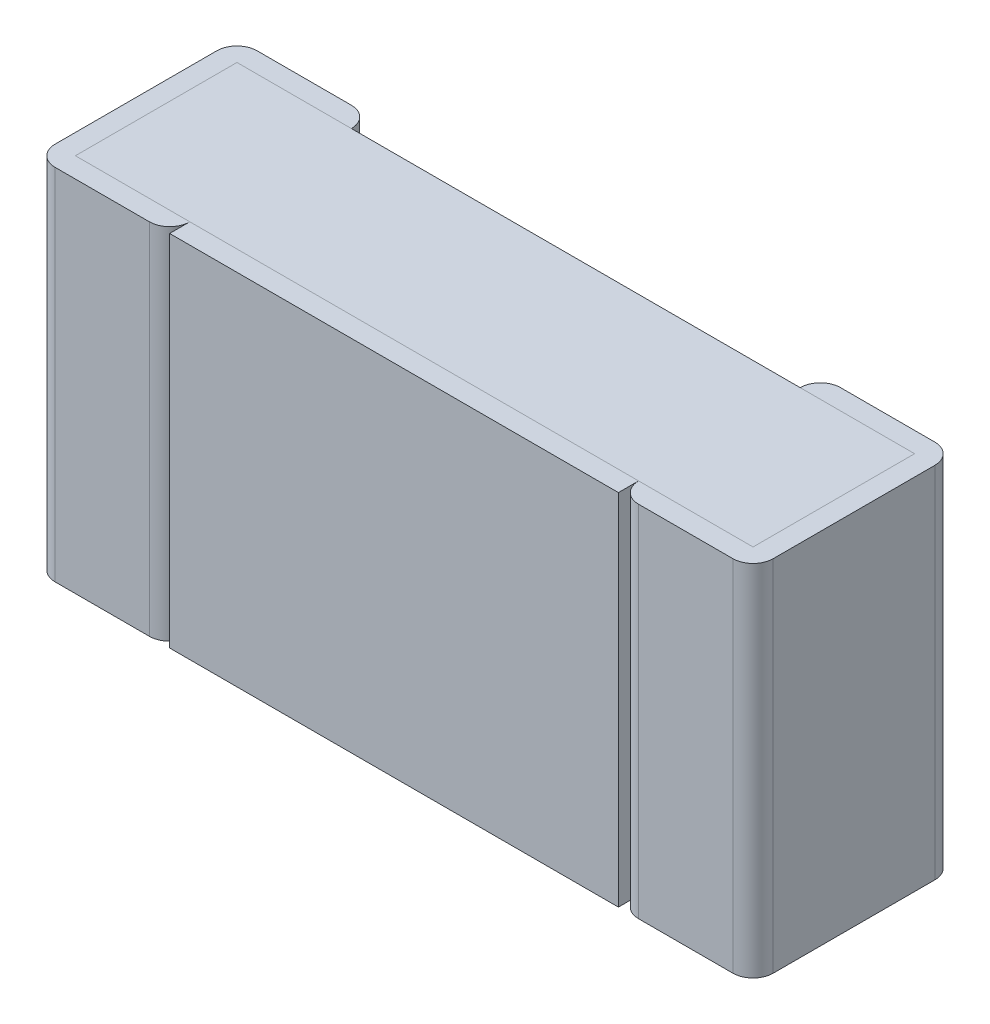
ISO-10303-21;
HEADER;
FILE_DESCRIPTION(('STEP AP214'),'2;1');
FILE_NAME('part.step','',(''),(''),'','','');
FILE_SCHEMA(('AUTOMOTIVE_DESIGN { 1 0 10303 214 1 1 1 1 }'));
ENDSEC;
DATA;
#1=APPLICATION_CONTEXT('core data for automotive mechanical design processes');
#2=APPLICATION_PROTOCOL_DEFINITION('international standard','automotive_design',2000,#1);
#3=PRODUCT_CONTEXT('',#1,'mechanical');
#4=PRODUCT('Part','Part','',(#3));
#5=PRODUCT_RELATED_PRODUCT_CATEGORY('part','',(#4));
#6=PRODUCT_DEFINITION_FORMATION('','',#4);
#7=PRODUCT_DEFINITION_CONTEXT('part definition',#1,'design');
#8=PRODUCT_DEFINITION('design','',#6,#7);
#9=PRODUCT_DEFINITION_SHAPE('','',#8);
#10=(LENGTH_UNIT() NAMED_UNIT(*) SI_UNIT(.MILLI.,.METRE.));
#11=(NAMED_UNIT(*) PLANE_ANGLE_UNIT() SI_UNIT($,.RADIAN.));
#12=(NAMED_UNIT(*) SI_UNIT($,.STERADIAN.) SOLID_ANGLE_UNIT());
#13=UNCERTAINTY_MEASURE_WITH_UNIT(LENGTH_MEASURE(1.E-05),#10,'distance_accuracy_value','');
#14=(GEOMETRIC_REPRESENTATION_CONTEXT(3) GLOBAL_UNCERTAINTY_ASSIGNED_CONTEXT((#13)) GLOBAL_UNIT_ASSIGNED_CONTEXT((#10,
#11,#12)) REPRESENTATION_CONTEXT('',''));
#15=CARTESIAN_POINT('',(0.,0.,0.));
#16=DIRECTION('',(0.,0.,1.));
#17=DIRECTION('',(1.,0.,0.));
#18=AXIS2_PLACEMENT_3D('',#15,#16,#17);
#19=CARTESIAN_POINT('',(162.543744279938,115.36204329235,112.661582908599));
#20=DIRECTION('',(0.,0.,1.));
#21=DIRECTION('',(1.,0.,0.));
#22=AXIS2_PLACEMENT_3D('',#19,#20,#21);
#23=PLANE('',#22);
#24=DIRECTION('',(0.,1.,0.));
#25=VECTOR('',#24,1.);
#26=CARTESIAN_POINT('',(162.543744279938,115.36204329235,112.661582908599));
#27=LINE('',#26,#25);
#28=CARTESIAN_POINT('',(162.543744279938,115.36204329235,112.661582908599));
#29=VERTEX_POINT('',#28);
#30=CARTESIAN_POINT('',(162.543744279938,116.16204329235,112.661582908599));
#31=VERTEX_POINT('',#30);
#32=EDGE_CURVE('E67',#29,#31,#27,.T.);
#33=ORIENTED_EDGE('',*,*,#32,.F.);
#34=DIRECTION('',(1.,0.,0.));
#35=VECTOR('',#34,1.);
#36=CARTESIAN_POINT('',(162.543744279938,115.36204329235,112.661582908599));
#37=LINE('',#36,#35);
#38=CARTESIAN_POINT('',(163.543744279938,115.36204329235,112.661582908599));
#39=VERTEX_POINT('',#38);
#40=EDGE_CURVE('E11',#29,#39,#37,.T.);
#41=ORIENTED_EDGE('',*,*,#40,.T.);
#42=DIRECTION('',(0.,1.,0.));
#43=VECTOR('',#42,1.);
#44=CARTESIAN_POINT('',(163.543744279938,115.36204329235,112.661582908599));
#45=LINE('',#44,#43);
#46=CARTESIAN_POINT('',(163.543744279938,116.16204329235,112.661582908599));
#47=VERTEX_POINT('',#46);
#48=EDGE_CURVE('E55',#39,#47,#45,.T.);
#49=ORIENTED_EDGE('',*,*,#48,.T.);
#50=DIRECTION('',(1.,0.,0.));
#51=VECTOR('',#50,1.);
#52=CARTESIAN_POINT('',(162.543744279938,116.16204329235,112.661582908599));
#53=LINE('',#52,#51);
#54=EDGE_CURVE('E319',#31,#47,#53,.T.);
#55=ORIENTED_EDGE('',*,*,#54,.F.);
#56=EDGE_LOOP('',(#33,#41,#49,#55));
#57=FACE_BOUND('',#56,.T.);
#58=ADVANCED_FACE('F44',(#57),#23,.T.);
#59=CARTESIAN_POINT('',(163.543744279938,115.36204329235,112.616582908599));
#60=DIRECTION('',(1.,0.,0.));
#61=DIRECTION('',(0.,1.,0.));
#62=AXIS2_PLACEMENT_3D('',#59,#60,#61);
#63=PLANE('',#62);
#64=DIRECTION('',(0.,0.,1.));
#65=VECTOR('',#64,1.);
#66=CARTESIAN_POINT('',(163.543744279938,115.36204329235,112.616582908599));
#67=LINE('',#66,#65);
#68=CARTESIAN_POINT('',(163.543744279938,115.36204329235,112.616582908599));
#69=VERTEX_POINT('',#68);
#70=EDGE_CURVE('E261',#69,#39,#67,.T.);
#71=ORIENTED_EDGE('',*,*,#70,.F.);
#72=DIRECTION('',(0.,1.,0.));
#73=VECTOR('',#72,1.);
#74=CARTESIAN_POINT('',(163.543744279938,115.36204329235,112.616582908599));
#75=LINE('',#74,#73);
#76=CARTESIAN_POINT('',(163.543744279938,116.16204329235,112.616582908599));
#77=VERTEX_POINT('',#76);
#78=EDGE_CURVE('E333',#69,#77,#75,.T.);
#79=ORIENTED_EDGE('',*,*,#78,.T.);
#80=DIRECTION('',(0.,0.,1.));
#81=VECTOR('',#80,1.);
#82=CARTESIAN_POINT('',(163.543744279938,116.16204329235,112.616582908599));
#83=LINE('',#82,#81);
#84=EDGE_CURVE('E329',#77,#47,#83,.T.);
#85=ORIENTED_EDGE('',*,*,#84,.T.);
#86=ORIENTED_EDGE('',*,*,#48,.F.);
#87=EDGE_LOOP('',(#71,#79,#85,#86));
#88=FACE_BOUND('',#87,.T.);
#89=ADVANCED_FACE('F581',(#88),#63,.T.);
#90=CARTESIAN_POINT('',(163.588744279938,115.36204329235,112.616582908599));
#91=DIRECTION('',(0.,1.,0.));
#92=DIRECTION('',(-1.,0.,0.));
#93=AXIS2_PLACEMENT_3D('',#90,#91,#92);
#94=CYLINDRICAL_SURFACE('',#93,0.0449999999999895);
#95=CARTESIAN_POINT('',(163.588744279938,115.36204329235,112.616582908599));
#96=DIRECTION('',(0.,1.,0.));
#97=DIRECTION('',(0.,0.,1.));
#98=AXIS2_PLACEMENT_3D('',#95,#96,#97);
#99=CIRCLE('',#98,0.0450000000000034);
#100=CARTESIAN_POINT('',(163.588744279938,115.36204329235,112.661582908599));
#101=VERTEX_POINT('',#100);
#102=EDGE_CURVE('E334',#69,#101,#99,.T.);
#103=ORIENTED_EDGE('',*,*,#102,.T.);
#104=DIRECTION('',(0.,1.,0.));
#105=VECTOR('',#104,1.);
#106=CARTESIAN_POINT('',(163.588744279938,115.36204329235,112.661582908599));
#107=LINE('',#106,#105);
#108=CARTESIAN_POINT('',(163.588744279938,116.16204329235,112.661582908599));
#109=VERTEX_POINT('',#108);
#110=EDGE_CURVE('E342',#101,#109,#107,.T.);
#111=ORIENTED_EDGE('',*,*,#110,.T.);
#112=CARTESIAN_POINT('',(163.588744279938,116.16204329235,112.616582908599));
#113=DIRECTION('',(0.,1.,0.));
#114=DIRECTION('',(0.,0.,1.));
#115=AXIS2_PLACEMENT_3D('',#112,#113,#114);
#116=CIRCLE('',#115,0.0450000000000034);
#117=EDGE_CURVE('E300',#77,#109,#116,.T.);
#118=ORIENTED_EDGE('',*,*,#117,.F.);
#119=ORIENTED_EDGE('',*,*,#78,.F.);
#120=EDGE_LOOP('',(#103,#111,#118,#119));
#121=FACE_BOUND('',#120,.T.);
#122=ADVANCED_FACE('F583',(#121),#94,.T.);
#123=CARTESIAN_POINT('',(163.543744279938,115.36204329235,112.661582908599));
#124=DIRECTION('',(0.,0.,1.));
#125=DIRECTION('',(1.,0.,0.));
#126=AXIS2_PLACEMENT_3D('',#123,#124,#125);
#127=PLANE('',#126);
#128=DIRECTION('',(1.,0.,0.));
#129=VECTOR('',#128,1.);
#130=CARTESIAN_POINT('',(163.543744279938,116.16204329235,112.661582908599));
#131=LINE('',#130,#129);
#132=CARTESIAN_POINT('',(163.798744279938,116.16204329235,112.661582908599));
#133=VERTEX_POINT('',#132);
#134=EDGE_CURVE('E298',#109,#133,#131,.T.);
#135=ORIENTED_EDGE('',*,*,#134,.F.);
#136=ORIENTED_EDGE('',*,*,#110,.F.);
#137=DIRECTION('',(1.,0.,0.));
#138=VECTOR('',#137,1.);
#139=CARTESIAN_POINT('',(163.543744279938,115.36204329235,112.661582908599));
#140=LINE('',#139,#138);
#141=CARTESIAN_POINT('',(163.798744279938,115.36204329235,112.661582908599));
#142=VERTEX_POINT('',#141);
#143=EDGE_CURVE('E346',#101,#142,#140,.T.);
#144=ORIENTED_EDGE('',*,*,#143,.T.);
#145=DIRECTION('',(0.,1.,0.));
#146=VECTOR('',#145,1.);
#147=CARTESIAN_POINT('',(163.798744279938,115.36204329235,112.661582908599));
#148=LINE('',#147,#146);
#149=EDGE_CURVE('E399',#142,#133,#148,.T.);
#150=ORIENTED_EDGE('',*,*,#149,.T.);
#151=EDGE_LOOP('',(#135,#136,#144,#150));
#152=FACE_BOUND('',#151,.T.);
#153=ADVANCED_FACE('F474',(#152),#127,.T.);
#154=CARTESIAN_POINT('',(163.798744279938,115.36204329235,112.616582908599));
#155=DIRECTION('',(0.,1.,0.));
#156=DIRECTION('',(1.,0.,0.));
#157=AXIS2_PLACEMENT_3D('',#154,#155,#156);
#158=CYLINDRICAL_SURFACE('',#157,0.0449999999999895);
#159=DIRECTION('',(0.,1.,0.));
#160=VECTOR('',#159,1.);
#161=CARTESIAN_POINT('',(163.843744279938,115.36204329235,112.616582908599));
#162=LINE('',#161,#160);
#163=CARTESIAN_POINT('',(163.843744279938,115.36204329235,112.616582908599));
#164=VERTEX_POINT('',#163);
#165=CARTESIAN_POINT('',(163.843744279938,116.16204329235,112.616582908599));
#166=VERTEX_POINT('',#165);
#167=EDGE_CURVE('E259',#164,#166,#162,.T.);
#168=ORIENTED_EDGE('',*,*,#167,.T.);
#169=CARTESIAN_POINT('',(163.798744279938,116.16204329235,112.616582908599));
#170=DIRECTION('',(0.,-1.,0.));
#171=DIRECTION('',(0.,0.,1.));
#172=AXIS2_PLACEMENT_3D('',#169,#170,#171);
#173=CIRCLE('',#172,0.0450000000000034);
#174=EDGE_CURVE('E255',#166,#133,#173,.T.);
#175=ORIENTED_EDGE('',*,*,#174,.T.);
#176=ORIENTED_EDGE('',*,*,#149,.F.);
#177=CARTESIAN_POINT('',(163.798744279938,115.36204329235,112.616582908599));
#178=DIRECTION('',(0.,-1.,0.));
#179=DIRECTION('',(0.,0.,1.));
#180=AXIS2_PLACEMENT_3D('',#177,#178,#179);
#181=CIRCLE('',#180,0.0450000000000034);
#182=EDGE_CURVE('E287',#164,#142,#181,.T.);
#183=ORIENTED_EDGE('',*,*,#182,.F.);
#184=EDGE_LOOP('',(#168,#175,#176,#183));
#185=FACE_BOUND('',#184,.T.);
#186=ADVANCED_FACE('F472',(#185),#158,.T.);
#187=CARTESIAN_POINT('',(163.843744279938,115.36204329235,112.211582908599));
#188=DIRECTION('',(1.,0.,0.));
#189=DIRECTION('',(0.,1.,0.));
#190=AXIS2_PLACEMENT_3D('',#187,#188,#189);
#191=PLANE('',#190);
#192=DIRECTION('',(0.,0.,1.));
#193=VECTOR('',#192,1.);
#194=CARTESIAN_POINT('',(163.843744279938,115.36204329235,112.211582908599));
#195=LINE('',#194,#193);
#196=CARTESIAN_POINT('',(163.843744279938,115.36204329235,112.256582908599));
#197=VERTEX_POINT('',#196);
#198=EDGE_CURVE('E283',#197,#164,#195,.T.);
#199=ORIENTED_EDGE('',*,*,#198,.F.);
#200=DIRECTION('',(0.,1.,0.));
#201=VECTOR('',#200,1.);
#202=CARTESIAN_POINT('',(163.843744279938,115.36204329235,112.256582908599));
#203=LINE('',#202,#201);
#204=CARTESIAN_POINT('',(163.843744279938,116.16204329235,112.256582908599));
#205=VERTEX_POINT('',#204);
#206=EDGE_CURVE('E260',#197,#205,#203,.T.);
#207=ORIENTED_EDGE('',*,*,#206,.T.);
#208=DIRECTION('',(0.,0.,1.));
#209=VECTOR('',#208,1.);
#210=CARTESIAN_POINT('',(163.843744279938,116.16204329235,112.211582908599));
#211=LINE('',#210,#209);
#212=EDGE_CURVE('E328',#205,#166,#211,.T.);
#213=ORIENTED_EDGE('',*,*,#212,.T.);
#214=ORIENTED_EDGE('',*,*,#167,.F.);
#215=EDGE_LOOP('',(#199,#207,#213,#214));
#216=FACE_BOUND('',#215,.T.);
#217=ADVANCED_FACE('F465',(#216),#191,.T.);
#218=CARTESIAN_POINT('',(163.798744279938,115.36204329235,112.256582908599));
#219=DIRECTION('',(0.,1.,0.));
#220=DIRECTION('',(1.,0.,0.));
#221=AXIS2_PLACEMENT_3D('',#218,#219,#220);
#222=CYLINDRICAL_SURFACE('',#221,0.0449999999999895);
#223=CARTESIAN_POINT('',(163.798744279938,115.36204329235,112.256582908599));
#224=DIRECTION('',(0.,1.,0.));
#225=DIRECTION('',(0.,0.,1.));
#226=AXIS2_PLACEMENT_3D('',#223,#224,#225);
#227=CIRCLE('',#226,0.0450000000000034);
#228=CARTESIAN_POINT('',(163.798744279938,115.36204329235,112.211582908599));
#229=VERTEX_POINT('',#228);
#230=EDGE_CURVE('E325',#197,#229,#227,.T.);
#231=ORIENTED_EDGE('',*,*,#230,.T.);
#232=DIRECTION('',(0.,1.,0.));
#233=VECTOR('',#232,1.);
#234=CARTESIAN_POINT('',(163.798744279938,115.36204329235,112.211582908599));
#235=LINE('',#234,#233);
#236=CARTESIAN_POINT('',(163.798744279938,116.16204329235,112.211582908599));
#237=VERTEX_POINT('',#236);
#238=EDGE_CURVE('E323',#229,#237,#235,.T.);
#239=ORIENTED_EDGE('',*,*,#238,.T.);
#240=CARTESIAN_POINT('',(163.798744279938,116.16204329235,112.256582908599));
#241=DIRECTION('',(0.,1.,0.));
#242=DIRECTION('',(0.,0.,1.));
#243=AXIS2_PLACEMENT_3D('',#240,#241,#242);
#244=CIRCLE('',#243,0.0450000000000034);
#245=EDGE_CURVE('E240',#205,#237,#244,.T.);
#246=ORIENTED_EDGE('',*,*,#245,.F.);
#247=ORIENTED_EDGE('',*,*,#206,.F.);
#248=EDGE_LOOP('',(#231,#239,#246,#247));
#249=FACE_BOUND('',#248,.T.);
#250=ADVANCED_FACE('F479',(#249),#222,.T.);
#251=CARTESIAN_POINT('',(163.543744279938,115.36204329235,112.211582908599));
#252=DIRECTION('',(0.,0.,1.));
#253=DIRECTION('',(1.,0.,0.));
#254=AXIS2_PLACEMENT_3D('',#251,#252,#253);
#255=PLANE('',#254);
#256=ORIENTED_EDGE('',*,*,#238,.F.);
#257=DIRECTION('',(1.,0.,0.));
#258=VECTOR('',#257,1.);
#259=CARTESIAN_POINT('',(163.543744279938,115.36204329235,112.211582908599));
#260=LINE('',#259,#258);
#261=CARTESIAN_POINT('',(163.588744279938,115.36204329235,112.211582908599));
#262=VERTEX_POINT('',#261);
#263=EDGE_CURVE('E425',#262,#229,#260,.T.);
#264=ORIENTED_EDGE('',*,*,#263,.F.);
#265=DIRECTION('',(0.,1.,0.));
#266=VECTOR('',#265,1.);
#267=CARTESIAN_POINT('',(163.588744279938,115.36204329235,112.211582908599));
#268=LINE('',#267,#266);
#269=CARTESIAN_POINT('',(163.588744279938,116.16204329235,112.211582908599));
#270=VERTEX_POINT('',#269);
#271=EDGE_CURVE('E292',#262,#270,#268,.T.);
#272=ORIENTED_EDGE('',*,*,#271,.T.);
#273=DIRECTION('',(1.,0.,0.));
#274=VECTOR('',#273,1.);
#275=CARTESIAN_POINT('',(163.543744279938,116.16204329235,112.211582908599));
#276=LINE('',#275,#274);
#277=EDGE_CURVE('E288',#270,#237,#276,.T.);
#278=ORIENTED_EDGE('',*,*,#277,.T.);
#279=EDGE_LOOP('',(#256,#264,#272,#278));
#280=FACE_BOUND('',#279,.T.);
#281=ADVANCED_FACE('F487',(#280),#255,.F.);
#282=CARTESIAN_POINT('',(163.588744279938,115.36204329235,112.256582908599));
#283=DIRECTION('',(0.,1.,0.));
#284=DIRECTION('',(-1.,0.,0.));
#285=AXIS2_PLACEMENT_3D('',#282,#283,#284);
#286=CYLINDRICAL_SURFACE('',#285,0.0449999999999895);
#287=DIRECTION('',(0.,1.,0.));
#288=VECTOR('',#287,1.);
#289=CARTESIAN_POINT('',(163.543744279938,115.36204329235,112.256582908599));
#290=LINE('',#289,#288);
#291=CARTESIAN_POINT('',(163.543744279938,115.36204329235,112.256582908599));
#292=VERTEX_POINT('',#291);
#293=CARTESIAN_POINT('',(163.543744279938,116.16204329235,112.256582908599));
#294=VERTEX_POINT('',#293);
#295=EDGE_CURVE('E293',#292,#294,#290,.T.);
#296=ORIENTED_EDGE('',*,*,#295,.T.);
#297=CARTESIAN_POINT('',(163.588744279938,116.16204329235,112.256582908599));
#298=DIRECTION('',(0.,-1.,0.));
#299=DIRECTION('',(0.,0.,1.));
#300=AXIS2_PLACEMENT_3D('',#297,#298,#299);
#301=CIRCLE('',#300,0.0450000000000034);
#302=EDGE_CURVE('E303',#294,#270,#301,.T.);
#303=ORIENTED_EDGE('',*,*,#302,.T.);
#304=ORIENTED_EDGE('',*,*,#271,.F.);
#305=CARTESIAN_POINT('',(163.588744279938,115.36204329235,112.256582908599));
#306=DIRECTION('',(0.,-1.,0.));
#307=DIRECTION('',(0.,0.,1.));
#308=AXIS2_PLACEMENT_3D('',#305,#306,#307);
#309=CIRCLE('',#308,0.0450000000000034);
#310=EDGE_CURVE('E429',#292,#262,#309,.T.);
#311=ORIENTED_EDGE('',*,*,#310,.F.);
#312=EDGE_LOOP('',(#296,#303,#304,#311));
#313=FACE_BOUND('',#312,.T.);
#314=ADVANCED_FACE('F621',(#313),#286,.T.);
#315=CARTESIAN_POINT('',(162.543744279938,116.16204329235,112.616582908599));
#316=DIRECTION('',(0.,1.,0.));
#317=DIRECTION('',(1.,0.,0.));
#318=AXIS2_PLACEMENT_3D('',#315,#316,#317);
#319=PLANE('',#318);
#320=DIRECTION('',(1.,0.,0.));
#321=VECTOR('',#320,1.);
#322=CARTESIAN_POINT('',(162.543744279938,116.16204329235,112.616582908599));
#323=LINE('',#322,#321);
#324=CARTESIAN_POINT('',(162.543744279938,116.16204329235,112.616582908599));
#325=VERTEX_POINT('',#324);
#326=EDGE_CURVE('E389',#325,#77,#323,.T.);
#327=ORIENTED_EDGE('',*,*,#326,.F.);
#328=DIRECTION('',(0.,0.,1.));
#329=VECTOR('',#328,1.);
#330=CARTESIAN_POINT('',(162.543744279938,116.16204329235,112.616582908599));
#331=LINE('',#330,#329);
#332=EDGE_CURVE('E311',#325,#31,#331,.T.);
#333=ORIENTED_EDGE('',*,*,#332,.T.);
#334=ORIENTED_EDGE('',*,*,#54,.T.);
#335=ORIENTED_EDGE('',*,*,#84,.F.);
#336=EDGE_LOOP('',(#327,#333,#334,#335));
#337=FACE_BOUND('',#336,.T.);
#338=ADVANCED_FACE('F575',(#337),#319,.T.);
#339=CARTESIAN_POINT('',(163.543744279938,116.16204329235,112.211582908599));
#340=DIRECTION('',(0.,1.,0.));
#341=DIRECTION('',(1.,0.,0.));
#342=AXIS2_PLACEMENT_3D('',#339,#340,#341);
#343=PLANE('',#342);
#344=ORIENTED_EDGE('',*,*,#277,.F.);
#345=ORIENTED_EDGE('',*,*,#302,.F.);
#346=DIRECTION('',(1.,0.,0.));
#347=VECTOR('',#346,1.);
#348=CARTESIAN_POINT('',(162.288744279938,116.16204329235,112.256582908599));
#349=LINE('',#348,#347);
#350=CARTESIAN_POINT('',(163.798744279938,116.16204329235,112.256582908599));
#351=VERTEX_POINT('',#350);
#352=EDGE_CURVE('E165',#294,#351,#349,.T.);
#353=ORIENTED_EDGE('',*,*,#352,.T.);
#354=DIRECTION('',(0.,0.,1.));
#355=VECTOR('',#354,1.);
#356=CARTESIAN_POINT('',(163.798744279938,116.16204329235,112.256582908599));
#357=LINE('',#356,#355);
#358=CARTESIAN_POINT('',(163.798744279938,116.16204329235,112.616582908599));
#359=VERTEX_POINT('',#358);
#360=EDGE_CURVE('E156',#351,#359,#357,.T.);
#361=ORIENTED_EDGE('',*,*,#360,.T.);
#362=DIRECTION('',(1.,0.,0.));
#363=VECTOR('',#362,1.);
#364=CARTESIAN_POINT('',(162.288744279938,116.16204329235,112.616582908599));
#365=LINE('',#364,#363);
#366=EDGE_CURVE('E282',#77,#359,#365,.T.);
#367=ORIENTED_EDGE('',*,*,#366,.F.);
#368=ORIENTED_EDGE('',*,*,#117,.T.);
#369=ORIENTED_EDGE('',*,*,#134,.T.);
#370=ORIENTED_EDGE('',*,*,#174,.F.);
#371=ORIENTED_EDGE('',*,*,#212,.F.);
#372=ORIENTED_EDGE('',*,*,#245,.T.);
#373=EDGE_LOOP('',(#344,#345,#353,#361,#367,#368,#369,#370,#371,#372));
#374=FACE_BOUND('',#373,.T.);
#375=ADVANCED_FACE('F469',(#374),#343,.T.);
#376=CARTESIAN_POINT('',(162.543744279938,115.36204329235,112.616582908599));
#377=DIRECTION('',(1.,0.,0.));
#378=DIRECTION('',(0.,1.,0.));
#379=AXIS2_PLACEMENT_3D('',#376,#377,#378);
#380=PLANE('',#379);
#381=ORIENTED_EDGE('',*,*,#32,.T.);
#382=ORIENTED_EDGE('',*,*,#332,.F.);
#383=DIRECTION('',(0.,1.,0.));
#384=VECTOR('',#383,1.);
#385=CARTESIAN_POINT('',(162.543744279938,115.36204329235,112.616582908599));
#386=LINE('',#385,#384);
#387=CARTESIAN_POINT('',(162.543744279938,115.36204329235,112.616582908599));
#388=VERTEX_POINT('',#387);
#389=EDGE_CURVE('E279',#388,#325,#386,.T.);
#390=ORIENTED_EDGE('',*,*,#389,.F.);
#391=DIRECTION('',(0.,0.,1.));
#392=VECTOR('',#391,1.);
#393=CARTESIAN_POINT('',(162.543744279938,115.36204329235,112.616582908599));
#394=LINE('',#393,#392);
#395=EDGE_CURVE('E265',#388,#29,#394,.T.);
#396=ORIENTED_EDGE('',*,*,#395,.T.);
#397=EDGE_LOOP('',(#381,#382,#390,#396));
#398=FACE_BOUND('',#397,.T.);
#399=ADVANCED_FACE('F572',(#398),#380,.F.);
#400=CARTESIAN_POINT('',(162.543744279938,115.36204329235,112.616582908599));
#401=DIRECTION('',(0.,1.,0.));
#402=DIRECTION('',(1.,0.,0.));
#403=AXIS2_PLACEMENT_3D('',#400,#401,#402);
#404=PLANE('',#403);
#405=ORIENTED_EDGE('',*,*,#70,.T.);
#406=ORIENTED_EDGE('',*,*,#40,.F.);
#407=ORIENTED_EDGE('',*,*,#395,.F.);
#408=DIRECTION('',(1.,0.,0.));
#409=VECTOR('',#408,1.);
#410=CARTESIAN_POINT('',(162.543744279938,115.36204329235,112.616582908599));
#411=LINE('',#410,#409);
#412=EDGE_CURVE('E266',#388,#69,#411,.T.);
#413=ORIENTED_EDGE('',*,*,#412,.T.);
#414=EDGE_LOOP('',(#405,#406,#407,#413));
#415=FACE_BOUND('',#414,.T.);
#416=ADVANCED_FACE('F586',(#415),#404,.F.);
#417=CARTESIAN_POINT('',(163.543744279938,115.36204329235,112.211582908599));
#418=DIRECTION('',(0.,1.,0.));
#419=DIRECTION('',(1.,0.,0.));
#420=AXIS2_PLACEMENT_3D('',#417,#418,#419);
#421=PLANE('',#420);
#422=ORIENTED_EDGE('',*,*,#230,.F.);
#423=ORIENTED_EDGE('',*,*,#198,.T.);
#424=ORIENTED_EDGE('',*,*,#182,.T.);
#425=ORIENTED_EDGE('',*,*,#143,.F.);
#426=ORIENTED_EDGE('',*,*,#102,.F.);
#427=DIRECTION('',(1.,0.,0.));
#428=VECTOR('',#427,1.);
#429=CARTESIAN_POINT('',(162.288744279938,115.36204329235,112.616582908599));
#430=LINE('',#429,#428);
#431=CARTESIAN_POINT('',(163.798744279938,115.36204329235,112.616582908599));
#432=VERTEX_POINT('',#431);
#433=EDGE_CURVE('E221',#69,#432,#430,.T.);
#434=ORIENTED_EDGE('',*,*,#433,.T.);
#435=DIRECTION('',(0.,0.,1.));
#436=VECTOR('',#435,1.);
#437=CARTESIAN_POINT('',(163.798744279938,115.36204329235,112.256582908599));
#438=LINE('',#437,#436);
#439=CARTESIAN_POINT('',(163.798744279938,115.36204329235,112.256582908599));
#440=VERTEX_POINT('',#439);
#441=EDGE_CURVE('E212',#440,#432,#438,.T.);
#442=ORIENTED_EDGE('',*,*,#441,.F.);
#443=DIRECTION('',(1.,0.,0.));
#444=VECTOR('',#443,1.);
#445=CARTESIAN_POINT('',(162.288744279938,115.36204329235,112.256582908599));
#446=LINE('',#445,#444);
#447=EDGE_CURVE('E217',#292,#440,#446,.T.);
#448=ORIENTED_EDGE('',*,*,#447,.F.);
#449=ORIENTED_EDGE('',*,*,#310,.T.);
#450=ORIENTED_EDGE('',*,*,#263,.T.);
#451=EDGE_LOOP('',(#422,#423,#424,#425,#426,#434,#442,#448,#449,#450));
#452=FACE_BOUND('',#451,.T.);
#453=ADVANCED_FACE('F215',(#452),#421,.F.);
#454=CARTESIAN_POINT('',(162.288744279938,115.36204329235,112.256582908599));
#455=DIRECTION('',(0.,0.,1.));
#456=DIRECTION('',(1.,0.,0.));
#457=AXIS2_PLACEMENT_3D('',#454,#455,#456);
#458=PLANE('',#457);
#459=DIRECTION('',(1.,0.,0.));
#460=VECTOR('',#459,1.);
#461=CARTESIAN_POINT('',(162.288744279938,116.16204329235,112.256582908599));
#462=LINE('',#461,#460);
#463=CARTESIAN_POINT('',(162.543744279938,116.16204329235,112.256582908599));
#464=VERTEX_POINT('',#463);
#465=EDGE_CURVE('E430',#464,#294,#462,.T.);
#466=ORIENTED_EDGE('',*,*,#465,.T.);
#467=ORIENTED_EDGE('',*,*,#295,.F.);
#468=DIRECTION('',(1.,0.,0.));
#469=VECTOR('',#468,1.);
#470=CARTESIAN_POINT('',(162.288744279938,115.36204329235,112.256582908599));
#471=LINE('',#470,#469);
#472=CARTESIAN_POINT('',(162.543744279938,115.36204329235,112.256582908599));
#473=VERTEX_POINT('',#472);
#474=EDGE_CURVE('E229',#473,#292,#471,.T.);
#475=ORIENTED_EDGE('',*,*,#474,.F.);
#476=DIRECTION('',(0.,1.,0.));
#477=VECTOR('',#476,1.);
#478=CARTESIAN_POINT('',(162.543744279938,115.36204329235,112.256582908599));
#479=LINE('',#478,#477);
#480=EDGE_CURVE('E424',#473,#464,#479,.T.);
#481=ORIENTED_EDGE('',*,*,#480,.T.);
#482=EDGE_LOOP('',(#466,#467,#475,#481));
#483=FACE_BOUND('',#482,.T.);
#484=ADVANCED_FACE('F590',(#483),#458,.F.);
#485=CARTESIAN_POINT('',(162.288744279938,116.16204329235,112.256582908599));
#486=DIRECTION('',(0.,1.,0.));
#487=DIRECTION('',(1.,0.,0.));
#488=AXIS2_PLACEMENT_3D('',#485,#486,#487);
#489=PLANE('',#488);
#490=DIRECTION('',(1.,0.,0.));
#491=VECTOR('',#490,1.);
#492=CARTESIAN_POINT('',(162.288744279938,116.16204329235,112.256582908599));
#493=LINE('',#492,#491);
#494=CARTESIAN_POINT('',(162.288744279938,116.16204329235,112.256582908599));
#495=VERTEX_POINT('',#494);
#496=EDGE_CURVE('E48',#495,#464,#493,.T.);
#497=ORIENTED_EDGE('',*,*,#496,.F.);
#498=DIRECTION('',(0.,0.,1.));
#499=VECTOR('',#498,1.);
#500=CARTESIAN_POINT('',(162.288744279938,116.16204329235,112.256582908599));
#501=LINE('',#500,#499);
#502=CARTESIAN_POINT('',(162.288744279938,116.16204329235,112.616582908599));
#503=VERTEX_POINT('',#502);
#504=EDGE_CURVE('E388',#495,#503,#501,.T.);
#505=ORIENTED_EDGE('',*,*,#504,.T.);
#506=DIRECTION('',(1.,0.,0.));
#507=VECTOR('',#506,1.);
#508=CARTESIAN_POINT('',(162.288744279938,116.16204329235,112.616582908599));
#509=LINE('',#508,#507);
#510=EDGE_CURVE('E384',#503,#325,#509,.T.);
#511=ORIENTED_EDGE('',*,*,#510,.T.);
#512=ORIENTED_EDGE('',*,*,#326,.T.);
#513=ORIENTED_EDGE('',*,*,#366,.T.);
#514=ORIENTED_EDGE('',*,*,#360,.F.);
#515=ORIENTED_EDGE('',*,*,#352,.F.);
#516=ORIENTED_EDGE('',*,*,#465,.F.);
#517=EDGE_LOOP('',(#497,#505,#511,#512,#513,#514,#515,#516));
#518=FACE_BOUND('',#517,.T.);
#519=ADVANCED_FACE('F46',(#518),#489,.T.);
#520=CARTESIAN_POINT('',(162.498744279938,115.36204329235,112.616582908599));
#521=DIRECTION('',(0.,1.,0.));
#522=DIRECTION('',(1.,0.,0.));
#523=AXIS2_PLACEMENT_3D('',#520,#521,#522);
#524=CYLINDRICAL_SURFACE('',#523,0.0449999999999895);
#525=ORIENTED_EDGE('',*,*,#389,.T.);
#526=CARTESIAN_POINT('',(162.498744279938,116.16204329235,112.616582908599));
#527=DIRECTION('',(0.,-1.,0.));
#528=DIRECTION('',(0.,0.,1.));
#529=AXIS2_PLACEMENT_3D('',#526,#527,#528);
#530=CIRCLE('',#529,0.0450000000000034);
#531=CARTESIAN_POINT('',(162.498744279938,116.16204329235,112.661582908599));
#532=VERTEX_POINT('',#531);
#533=EDGE_CURVE('E251',#325,#532,#530,.T.);
#534=ORIENTED_EDGE('',*,*,#533,.T.);
#535=DIRECTION('',(0.,1.,0.));
#536=VECTOR('',#535,1.);
#537=CARTESIAN_POINT('',(162.498744279938,115.36204329235,112.661582908599));
#538=LINE('',#537,#536);
#539=CARTESIAN_POINT('',(162.498744279938,115.36204329235,112.661582908599));
#540=VERTEX_POINT('',#539);
#541=EDGE_CURVE('E236',#540,#532,#538,.T.);
#542=ORIENTED_EDGE('',*,*,#541,.F.);
#543=CARTESIAN_POINT('',(162.498744279938,115.36204329235,112.616582908599));
#544=DIRECTION('',(0.,-1.,0.));
#545=DIRECTION('',(0.,0.,1.));
#546=AXIS2_PLACEMENT_3D('',#543,#544,#545);
#547=CIRCLE('',#546,0.0450000000000034);
#548=EDGE_CURVE('E271',#388,#540,#547,.T.);
#549=ORIENTED_EDGE('',*,*,#548,.F.);
#550=EDGE_LOOP('',(#525,#534,#542,#549));
#551=FACE_BOUND('',#550,.T.);
#552=ADVANCED_FACE('F645',(#551),#524,.T.);
#553=CARTESIAN_POINT('',(162.243744279938,115.36204329235,112.661582908599));
#554=DIRECTION('',(0.,0.,1.));
#555=DIRECTION('',(1.,0.,0.));
#556=AXIS2_PLACEMENT_3D('',#553,#554,#555);
#557=PLANE('',#556);
#558=DIRECTION('',(1.,0.,0.));
#559=VECTOR('',#558,1.);
#560=CARTESIAN_POINT('',(162.243744279938,116.16204329235,112.661582908599));
#561=LINE('',#560,#559);
#562=CARTESIAN_POINT('',(162.288744279938,116.16204329235,112.661582908599));
#563=VERTEX_POINT('',#562);
#564=EDGE_CURVE('E390',#563,#532,#561,.T.);
#565=ORIENTED_EDGE('',*,*,#564,.F.);
#566=DIRECTION('',(0.,1.,0.));
#567=VECTOR('',#566,1.);
#568=CARTESIAN_POINT('',(162.288744279938,115.36204329235,112.661582908599));
#569=LINE('',#568,#567);
#570=CARTESIAN_POINT('',(162.288744279938,115.36204329235,112.661582908599));
#571=VERTEX_POINT('',#570);
#572=EDGE_CURVE('E245',#571,#563,#569,.T.);
#573=ORIENTED_EDGE('',*,*,#572,.F.);
#574=DIRECTION('',(1.,0.,0.));
#575=VECTOR('',#574,1.);
#576=CARTESIAN_POINT('',(162.243744279938,115.36204329235,112.661582908599));
#577=LINE('',#576,#575);
#578=EDGE_CURVE('E247',#571,#540,#577,.T.);
#579=ORIENTED_EDGE('',*,*,#578,.T.);
#580=ORIENTED_EDGE('',*,*,#541,.T.);
#581=EDGE_LOOP('',(#565,#573,#579,#580));
#582=FACE_BOUND('',#581,.T.);
#583=ADVANCED_FACE('F536',(#582),#557,.T.);
#584=CARTESIAN_POINT('',(162.288744279938,115.36204329235,112.256582908599));
#585=DIRECTION('',(0.,1.,0.));
#586=DIRECTION('',(1.,0.,0.));
#587=AXIS2_PLACEMENT_3D('',#584,#585,#586);
#588=PLANE('',#587);
#589=ORIENTED_EDGE('',*,*,#474,.T.);
#590=ORIENTED_EDGE('',*,*,#447,.T.);
#591=ORIENTED_EDGE('',*,*,#441,.T.);
#592=ORIENTED_EDGE('',*,*,#433,.F.);
#593=ORIENTED_EDGE('',*,*,#412,.F.);
#594=DIRECTION('',(1.,0.,0.));
#595=VECTOR('',#594,1.);
#596=CARTESIAN_POINT('',(162.288744279938,115.36204329235,112.616582908599));
#597=LINE('',#596,#595);
#598=CARTESIAN_POINT('',(162.288744279938,115.36204329235,112.616582908599));
#599=VERTEX_POINT('',#598);
#600=EDGE_CURVE('E355',#599,#388,#597,.T.);
#601=ORIENTED_EDGE('',*,*,#600,.F.);
#602=DIRECTION('',(0.,0.,1.));
#603=VECTOR('',#602,1.);
#604=CARTESIAN_POINT('',(162.288744279938,115.36204329235,112.256582908599));
#605=LINE('',#604,#603);
#606=CARTESIAN_POINT('',(162.288744279938,115.36204329235,112.256582908599));
#607=VERTEX_POINT('',#606);
#608=EDGE_CURVE('E297',#607,#599,#605,.T.);
#609=ORIENTED_EDGE('',*,*,#608,.F.);
#610=DIRECTION('',(1.,0.,0.));
#611=VECTOR('',#610,1.);
#612=CARTESIAN_POINT('',(162.288744279938,115.36204329235,112.256582908599));
#613=LINE('',#612,#611);
#614=EDGE_CURVE('E224',#607,#473,#613,.T.);
#615=ORIENTED_EDGE('',*,*,#614,.T.);
#616=EDGE_LOOP('',(#589,#590,#591,#592,#593,#601,#609,#615));
#617=FACE_BOUND('',#616,.T.);
#618=ADVANCED_FACE('F227',(#617),#588,.F.);
#619=CARTESIAN_POINT('',(162.498744279938,115.36204329235,112.256582908599));
#620=DIRECTION('',(0.,1.,0.));
#621=DIRECTION('',(1.,0.,0.));
#622=AXIS2_PLACEMENT_3D('',#619,#620,#621);
#623=CYLINDRICAL_SURFACE('',#622,0.0449999999999895);
#624=CARTESIAN_POINT('',(162.498744279938,115.36204329235,112.256582908599));
#625=DIRECTION('',(0.,1.,0.));
#626=DIRECTION('',(0.,0.,1.));
#627=AXIS2_PLACEMENT_3D('',#624,#625,#626);
#628=CIRCLE('',#627,0.0450000000000034);
#629=CARTESIAN_POINT('',(162.498744279938,115.36204329235,112.211582908599));
#630=VERTEX_POINT('',#629);
#631=EDGE_CURVE('E395',#473,#630,#628,.T.);
#632=ORIENTED_EDGE('',*,*,#631,.T.);
#633=DIRECTION('',(0.,1.,0.));
#634=VECTOR('',#633,1.);
#635=CARTESIAN_POINT('',(162.498744279938,115.36204329235,112.211582908599));
#636=LINE('',#635,#634);
#637=CARTESIAN_POINT('',(162.498744279938,116.16204329235,112.211582908599));
#638=VERTEX_POINT('',#637);
#639=EDGE_CURVE('E398',#630,#638,#636,.T.);
#640=ORIENTED_EDGE('',*,*,#639,.T.);
#641=CARTESIAN_POINT('',(162.498744279938,116.16204329235,112.256582908599));
#642=DIRECTION('',(0.,1.,0.));
#643=DIRECTION('',(0.,0.,1.));
#644=AXIS2_PLACEMENT_3D('',#641,#642,#643);
#645=CIRCLE('',#644,0.0450000000000034);
#646=EDGE_CURVE('E365',#464,#638,#645,.T.);
#647=ORIENTED_EDGE('',*,*,#646,.F.);
#648=ORIENTED_EDGE('',*,*,#480,.F.);
#649=EDGE_LOOP('',(#632,#640,#647,#648));
#650=FACE_BOUND('',#649,.T.);
#651=ADVANCED_FACE('F592',(#650),#623,.T.);
#652=CARTESIAN_POINT('',(162.243744279938,115.36204329235,112.211582908599));
#653=DIRECTION('',(0.,0.,1.));
#654=DIRECTION('',(1.,0.,0.));
#655=AXIS2_PLACEMENT_3D('',#652,#653,#654);
#656=PLANE('',#655);
#657=ORIENTED_EDGE('',*,*,#639,.F.);
#658=DIRECTION('',(1.,0.,0.));
#659=VECTOR('',#658,1.);
#660=CARTESIAN_POINT('',(162.243744279938,115.36204329235,112.211582908599));
#661=LINE('',#660,#659);
#662=CARTESIAN_POINT('',(162.288744279938,115.36204329235,112.211582908599));
#663=VERTEX_POINT('',#662);
#664=EDGE_CURVE('E272',#663,#630,#661,.T.);
#665=ORIENTED_EDGE('',*,*,#664,.F.);
#666=DIRECTION('',(0.,1.,0.));
#667=VECTOR('',#666,1.);
#668=CARTESIAN_POINT('',(162.288744279938,115.36204329235,112.211582908599));
#669=LINE('',#668,#667);
#670=CARTESIAN_POINT('',(162.288744279938,116.16204329235,112.211582908599));
#671=VERTEX_POINT('',#670);
#672=EDGE_CURVE('E277',#663,#671,#669,.T.);
#673=ORIENTED_EDGE('',*,*,#672,.T.);
#674=DIRECTION('',(1.,0.,0.));
#675=VECTOR('',#674,1.);
#676=CARTESIAN_POINT('',(162.243744279938,116.16204329235,112.211582908599));
#677=LINE('',#676,#675);
#678=EDGE_CURVE('E273',#671,#638,#677,.T.);
#679=ORIENTED_EDGE('',*,*,#678,.T.);
#680=EDGE_LOOP('',(#657,#665,#673,#679));
#681=FACE_BOUND('',#680,.T.);
#682=ADVANCED_FACE('F512',(#681),#656,.F.);
#683=CARTESIAN_POINT('',(162.243744279938,116.16204329235,112.211582908599));
#684=DIRECTION('',(0.,1.,0.));
#685=DIRECTION('',(1.,0.,0.));
#686=AXIS2_PLACEMENT_3D('',#683,#684,#685);
#687=PLANE('',#686);
#688=ORIENTED_EDGE('',*,*,#678,.F.);
#689=CARTESIAN_POINT('',(162.288744279938,116.16204329235,112.256582908599));
#690=DIRECTION('',(0.,-1.,0.));
#691=DIRECTION('',(0.,0.,1.));
#692=AXIS2_PLACEMENT_3D('',#689,#690,#691);
#693=CIRCLE('',#692,0.0450000000000034);
#694=CARTESIAN_POINT('',(162.243744279938,116.16204329235,112.256582908599));
#695=VERTEX_POINT('',#694);
#696=EDGE_CURVE('E246',#695,#671,#693,.T.);
#697=ORIENTED_EDGE('',*,*,#696,.F.);
#698=DIRECTION('',(0.,0.,1.));
#699=VECTOR('',#698,1.);
#700=CARTESIAN_POINT('',(162.243744279938,116.16204329235,112.211582908599));
#701=LINE('',#700,#699);
#702=CARTESIAN_POINT('',(162.243744279938,116.16204329235,112.616582908599));
#703=VERTEX_POINT('',#702);
#704=EDGE_CURVE('E278',#695,#703,#701,.T.);
#705=ORIENTED_EDGE('',*,*,#704,.T.);
#706=CARTESIAN_POINT('',(162.288744279938,116.16204329235,112.616582908599));
#707=DIRECTION('',(0.,1.,0.));
#708=DIRECTION('',(0.,0.,1.));
#709=AXIS2_PLACEMENT_3D('',#706,#707,#708);
#710=CIRCLE('',#709,0.0450000000000034);
#711=EDGE_CURVE('E394',#703,#563,#710,.T.);
#712=ORIENTED_EDGE('',*,*,#711,.T.);
#713=ORIENTED_EDGE('',*,*,#564,.T.);
#714=ORIENTED_EDGE('',*,*,#533,.F.);
#715=ORIENTED_EDGE('',*,*,#510,.F.);
#716=ORIENTED_EDGE('',*,*,#504,.F.);
#717=ORIENTED_EDGE('',*,*,#496,.T.);
#718=ORIENTED_EDGE('',*,*,#646,.T.);
#719=EDGE_LOOP('',(#688,#697,#705,#712,#713,#714,#715,#716,#717,#718));
#720=FACE_BOUND('',#719,.T.);
#721=ADVANCED_FACE('F522',(#720),#687,.T.);
#722=CARTESIAN_POINT('',(162.288744279938,115.36204329235,112.616582908599));
#723=DIRECTION('',(0.,1.,0.));
#724=DIRECTION('',(-1.,0.,0.));
#725=AXIS2_PLACEMENT_3D('',#722,#723,#724);
#726=CYLINDRICAL_SURFACE('',#725,0.0449999999999895);
#727=CARTESIAN_POINT('',(162.288744279938,115.36204329235,112.616582908599));
#728=DIRECTION('',(0.,1.,0.));
#729=DIRECTION('',(0.,0.,1.));
#730=AXIS2_PLACEMENT_3D('',#727,#728,#729);
#731=CIRCLE('',#730,0.0450000000000034);
#732=CARTESIAN_POINT('',(162.243744279938,115.36204329235,112.616582908599));
#733=VERTEX_POINT('',#732);
#734=EDGE_CURVE('E341',#733,#571,#731,.T.);
#735=ORIENTED_EDGE('',*,*,#734,.T.);
#736=ORIENTED_EDGE('',*,*,#572,.T.);
#737=ORIENTED_EDGE('',*,*,#711,.F.);
#738=DIRECTION('',(0.,1.,0.));
#739=VECTOR('',#738,1.);
#740=CARTESIAN_POINT('',(162.243744279938,115.36204329235,112.616582908599));
#741=LINE('',#740,#739);
#742=EDGE_CURVE('E338',#733,#703,#741,.T.);
#743=ORIENTED_EDGE('',*,*,#742,.F.);
#744=EDGE_LOOP('',(#735,#736,#737,#743));
#745=FACE_BOUND('',#744,.T.);
#746=ADVANCED_FACE('F528',(#745),#726,.T.);
#747=CARTESIAN_POINT('',(162.288744279938,115.36204329235,112.256582908599));
#748=DIRECTION('',(0.,1.,0.));
#749=DIRECTION('',(-1.,0.,0.));
#750=AXIS2_PLACEMENT_3D('',#747,#748,#749);
#751=CYLINDRICAL_SURFACE('',#750,0.0449999999999895);
#752=DIRECTION('',(0.,1.,0.));
#753=VECTOR('',#752,1.);
#754=CARTESIAN_POINT('',(162.243744279938,115.36204329235,112.256582908599));
#755=LINE('',#754,#753);
#756=CARTESIAN_POINT('',(162.243744279938,115.36204329235,112.256582908599));
#757=VERTEX_POINT('',#756);
#758=EDGE_CURVE('E242',#757,#695,#755,.T.);
#759=ORIENTED_EDGE('',*,*,#758,.T.);
#760=ORIENTED_EDGE('',*,*,#696,.T.);
#761=ORIENTED_EDGE('',*,*,#672,.F.);
#762=CARTESIAN_POINT('',(162.288744279938,115.36204329235,112.256582908599));
#763=DIRECTION('',(0.,-1.,0.));
#764=DIRECTION('',(0.,0.,1.));
#765=AXIS2_PLACEMENT_3D('',#762,#763,#764);
#766=CIRCLE('',#765,0.0450000000000034);
#767=EDGE_CURVE('E267',#757,#663,#766,.T.);
#768=ORIENTED_EDGE('',*,*,#767,.F.);
#769=EDGE_LOOP('',(#759,#760,#761,#768));
#770=FACE_BOUND('',#769,.T.);
#771=ADVANCED_FACE('F518',(#770),#751,.T.);
#772=CARTESIAN_POINT('',(162.243744279938,115.36204329235,112.211582908599));
#773=DIRECTION('',(0.,1.,0.));
#774=DIRECTION('',(1.,0.,0.));
#775=AXIS2_PLACEMENT_3D('',#772,#773,#774);
#776=PLANE('',#775);
#777=ORIENTED_EDGE('',*,*,#631,.F.);
#778=ORIENTED_EDGE('',*,*,#614,.F.);
#779=ORIENTED_EDGE('',*,*,#608,.T.);
#780=ORIENTED_EDGE('',*,*,#600,.T.);
#781=ORIENTED_EDGE('',*,*,#548,.T.);
#782=ORIENTED_EDGE('',*,*,#578,.F.);
#783=ORIENTED_EDGE('',*,*,#734,.F.);
#784=DIRECTION('',(0.,0.,1.));
#785=VECTOR('',#784,1.);
#786=CARTESIAN_POINT('',(162.243744279938,115.36204329235,112.211582908599));
#787=LINE('',#786,#785);
#788=EDGE_CURVE('E369',#757,#733,#787,.T.);
#789=ORIENTED_EDGE('',*,*,#788,.F.);
#790=ORIENTED_EDGE('',*,*,#767,.T.);
#791=ORIENTED_EDGE('',*,*,#664,.T.);
#792=EDGE_LOOP('',(#777,#778,#779,#780,#781,#782,#783,#789,#790,#791));
#793=FACE_BOUND('',#792,.T.);
#794=ADVANCED_FACE('F532',(#793),#776,.F.);
#795=CARTESIAN_POINT('',(162.243744279938,115.36204329235,112.211582908599));
#796=DIRECTION('',(1.,0.,0.));
#797=DIRECTION('',(0.,1.,0.));
#798=AXIS2_PLACEMENT_3D('',#795,#796,#797);
#799=PLANE('',#798);
#800=ORIENTED_EDGE('',*,*,#742,.T.);
#801=ORIENTED_EDGE('',*,*,#704,.F.);
#802=ORIENTED_EDGE('',*,*,#758,.F.);
#803=ORIENTED_EDGE('',*,*,#788,.T.);
#804=EDGE_LOOP('',(#800,#801,#802,#803));
#805=FACE_BOUND('',#804,.T.);
#806=ADVANCED_FACE('F524',(#805),#799,.F.);
#807=CLOSED_SHELL('',(#58,#89,#122,#153,#186,#217,#250,#281,#314,#338,#375,#399,#416,#453,#484,
#519,#552,#583,#618,#651,#682,#721,#746,#771,#794,#806));
#808=MANIFOLD_SOLID_BREP('B2',#807);
#809=ADVANCED_BREP_SHAPE_REPRESENTATION('',(#18,#808),#14);
#810=SHAPE_DEFINITION_REPRESENTATION(#9,#809);
ENDSEC;
END-ISO-10303-21;
